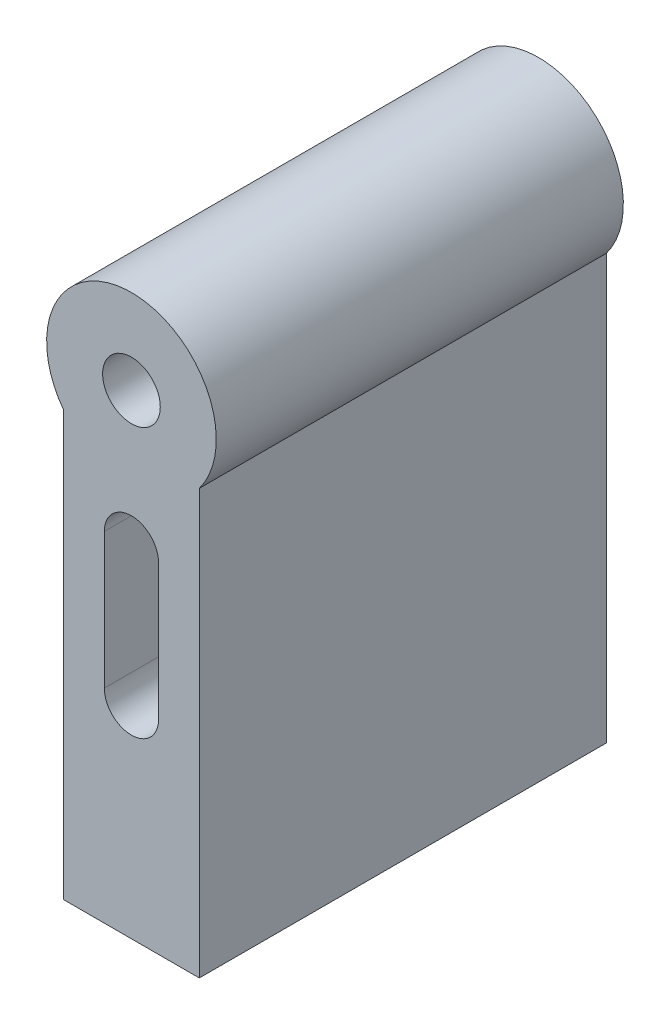
ISO-10303-21;
HEADER;
FILE_DESCRIPTION(('STEP AP214'),'2;1');
FILE_NAME('part.step','',(''),(''),'','','');
FILE_SCHEMA(('AUTOMOTIVE_DESIGN { 1 0 10303 214 1 1 1 1 }'));
ENDSEC;
DATA;
#1=APPLICATION_CONTEXT('core data for automotive mechanical design processes');
#2=APPLICATION_PROTOCOL_DEFINITION('international standard','automotive_design',2000,#1);
#3=PRODUCT_CONTEXT('',#1,'mechanical');
#4=PRODUCT('Part','Part','',(#3));
#5=PRODUCT_RELATED_PRODUCT_CATEGORY('part','',(#4));
#6=PRODUCT_DEFINITION_FORMATION('','',#4);
#7=PRODUCT_DEFINITION_CONTEXT('part definition',#1,'design');
#8=PRODUCT_DEFINITION('design','',#6,#7);
#9=PRODUCT_DEFINITION_SHAPE('','',#8);
#10=(LENGTH_UNIT() NAMED_UNIT(*) SI_UNIT(.MILLI.,.METRE.));
#11=(NAMED_UNIT(*) PLANE_ANGLE_UNIT() SI_UNIT($,.RADIAN.));
#12=(NAMED_UNIT(*) SI_UNIT($,.STERADIAN.) SOLID_ANGLE_UNIT());
#13=UNCERTAINTY_MEASURE_WITH_UNIT(LENGTH_MEASURE(1.E-05),#10,'distance_accuracy_value','');
#14=(GEOMETRIC_REPRESENTATION_CONTEXT(3) GLOBAL_UNCERTAINTY_ASSIGNED_CONTEXT((#13)) GLOBAL_UNIT_ASSIGNED_CONTEXT((#10,
#11,#12)) REPRESENTATION_CONTEXT('',''));
#15=CARTESIAN_POINT('',(0.,0.,0.));
#16=DIRECTION('',(0.,0.,1.));
#17=DIRECTION('',(1.,0.,0.));
#18=AXIS2_PLACEMENT_3D('',#15,#16,#17);
#19=CARTESIAN_POINT('',(-4.,-3.,12.));
#20=DIRECTION('',(1.,0.,0.));
#21=DIRECTION('',(0.,1.,0.));
#22=AXIS2_PLACEMENT_3D('',#19,#20,#21);
#23=PLANE('',#22);
#24=DIRECTION('',(0.,0.,-1.));
#25=VECTOR('',#24,1.);
#26=CARTESIAN_POINT('',(-4.,-20.2,12.));
#27=LINE('',#26,#25);
#28=CARTESIAN_POINT('',(-4.,-20.2,-4.05));
#29=VERTEX_POINT('',#28);
#30=CARTESIAN_POINT('',(-4.,-20.2,-9.95));
#31=VERTEX_POINT('',#30);
#32=EDGE_CURVE('E253',#29,#31,#27,.T.);
#33=ORIENTED_EDGE('',*,*,#32,.F.);
#34=DIRECTION('',(0.,-1.,0.));
#35=VECTOR('',#34,1.);
#36=CARTESIAN_POINT('',(-4.,-3.,-4.05));
#37=LINE('',#36,#35);
#38=CARTESIAN_POINT('',(-4.,-24.2,-4.05));
#39=VERTEX_POINT('',#38);
#40=EDGE_CURVE('E328',#29,#39,#37,.T.);
#41=ORIENTED_EDGE('',*,*,#40,.T.);
#42=DIRECTION('',(0.,0.,-1.));
#43=VECTOR('',#42,1.);
#44=CARTESIAN_POINT('',(-4.,-24.2,12.));
#45=LINE('',#44,#43);
#46=CARTESIAN_POINT('',(-4.,-24.2,-9.95));
#47=VERTEX_POINT('',#46);
#48=EDGE_CURVE('E249',#39,#47,#45,.T.);
#49=ORIENTED_EDGE('',*,*,#48,.T.);
#50=DIRECTION('',(0.,1.,0.));
#51=VECTOR('',#50,1.);
#52=CARTESIAN_POINT('',(-4.,-3.,-9.95));
#53=LINE('',#52,#51);
#54=EDGE_CURVE('E335',#47,#31,#53,.T.);
#55=ORIENTED_EDGE('',*,*,#54,.T.);
#56=EDGE_LOOP('',(#33,#41,#49,#55));
#57=FACE_BOUND('',#56,.T.);
#58=DIRECTION('',(0.,-1.,0.));
#59=VECTOR('',#58,1.);
#60=CARTESIAN_POINT('',(-4.,-3.,-12.));
#61=LINE('',#60,#59);
#62=CARTESIAN_POINT('',(-4.,-3.,-12.));
#63=VERTEX_POINT('',#62);
#64=CARTESIAN_POINT('',(-4.,-28.,-12.));
#65=VERTEX_POINT('',#64);
#66=EDGE_CURVE('E312',#63,#65,#61,.T.);
#67=ORIENTED_EDGE('',*,*,#66,.T.);
#68=DIRECTION('',(0.,0.,-1.));
#69=VECTOR('',#68,1.);
#70=CARTESIAN_POINT('',(-4.,-28.,12.));
#71=LINE('',#70,#69);
#72=CARTESIAN_POINT('',(-4.,-28.,12.));
#73=VERTEX_POINT('',#72);
#74=EDGE_CURVE('E322',#73,#65,#71,.T.);
#75=ORIENTED_EDGE('',*,*,#74,.F.);
#76=DIRECTION('',(0.,-1.,0.));
#77=VECTOR('',#76,1.);
#78=CARTESIAN_POINT('',(-4.,-3.,12.));
#79=LINE('',#78,#77);
#80=CARTESIAN_POINT('',(-4.,-3.,12.));
#81=VERTEX_POINT('',#80);
#82=EDGE_CURVE('E302',#81,#73,#79,.T.);
#83=ORIENTED_EDGE('',*,*,#82,.F.);
#84=DIRECTION('',(0.,0.,-1.));
#85=VECTOR('',#84,1.);
#86=CARTESIAN_POINT('',(-4.,-3.,12.));
#87=LINE('',#86,#85);
#88=EDGE_CURVE('E325',#81,#63,#87,.T.);
#89=ORIENTED_EDGE('',*,*,#88,.T.);
#90=EDGE_LOOP('',(#67,#75,#83,#89));
#91=FACE_BOUND('',#90,.T.);
#92=DIRECTION('',(0.,0.,-1.));
#93=VECTOR('',#92,1.);
#94=CARTESIAN_POINT('',(-4.,-20.2,12.));
#95=LINE('',#94,#93);
#96=CARTESIAN_POINT('',(-4.,-20.2,9.95));
#97=VERTEX_POINT('',#96);
#98=CARTESIAN_POINT('',(-4.,-20.2,4.05));
#99=VERTEX_POINT('',#98);
#100=EDGE_CURVE('E184',#97,#99,#95,.T.);
#101=ORIENTED_EDGE('',*,*,#100,.F.);
#102=DIRECTION('',(0.,1.,0.));
#103=VECTOR('',#102,1.);
#104=CARTESIAN_POINT('',(-4.,-3.,9.95));
#105=LINE('',#104,#103);
#106=CARTESIAN_POINT('',(-4.,-24.2,9.95));
#107=VERTEX_POINT('',#106);
#108=EDGE_CURVE('E61',#107,#97,#105,.T.);
#109=ORIENTED_EDGE('',*,*,#108,.F.);
#110=DIRECTION('',(0.,0.,-1.));
#111=VECTOR('',#110,1.);
#112=CARTESIAN_POINT('',(-4.,-24.2,12.));
#113=LINE('',#112,#111);
#114=CARTESIAN_POINT('',(-4.,-24.2,4.05));
#115=VERTEX_POINT('',#114);
#116=EDGE_CURVE('E207',#107,#115,#113,.T.);
#117=ORIENTED_EDGE('',*,*,#116,.T.);
#118=DIRECTION('',(0.,-1.,0.));
#119=VECTOR('',#118,1.);
#120=CARTESIAN_POINT('',(-4.,-3.,4.05));
#121=LINE('',#120,#119);
#122=EDGE_CURVE('E13',#99,#115,#121,.T.);
#123=ORIENTED_EDGE('',*,*,#122,.F.);
#124=EDGE_LOOP('',(#101,#109,#117,#123));
#125=FACE_BOUND('',#124,.T.);
#126=ADVANCED_FACE('F53',(#57,#91,#125),#23,.F.);
#127=CARTESIAN_POINT('',(0.,0.,12.));
#128=DIRECTION('',(0.,0.,-1.));
#129=DIRECTION('',(-1.,0.,0.));
#130=AXIS2_PLACEMENT_3D('',#127,#128,#129);
#131=PLANE('',#130);
#132=CARTESIAN_POINT('',(0.,0.,12.));
#133=DIRECTION('',(0.,0.,1.));
#134=DIRECTION('',(1.,0.,0.));
#135=AXIS2_PLACEMENT_3D('',#132,#133,#134);
#136=CIRCLE('',#135,1.7);
#137=CARTESIAN_POINT('',(1.7,0.,12.));
#138=VERTEX_POINT('',#137);
#139=EDGE_CURVE('E293',#138,#138,#136,.T.);
#140=ORIENTED_EDGE('',*,*,#139,.F.);
#141=EDGE_LOOP('',(#140));
#142=FACE_BOUND('',#141,.T.);
#143=CARTESIAN_POINT('',(0.,0.,12.));
#144=DIRECTION('',(0.,0.,1.));
#145=DIRECTION('',(-1.,0.,0.));
#146=AXIS2_PLACEMENT_3D('',#143,#144,#145);
#147=CIRCLE('',#146,5.);
#148=CARTESIAN_POINT('',(4.,-3.,12.));
#149=VERTEX_POINT('',#148);
#150=EDGE_CURVE('E299',#149,#81,#147,.T.);
#151=ORIENTED_EDGE('',*,*,#150,.T.);
#152=ORIENTED_EDGE('',*,*,#82,.T.);
#153=DIRECTION('',(1.,0.,0.));
#154=VECTOR('',#153,1.);
#155=CARTESIAN_POINT('',(-4.,-28.,12.));
#156=LINE('',#155,#154);
#157=CARTESIAN_POINT('',(4.,-28.,12.));
#158=VERTEX_POINT('',#157);
#159=EDGE_CURVE('E305',#73,#158,#156,.T.);
#160=ORIENTED_EDGE('',*,*,#159,.T.);
#161=DIRECTION('',(0.,1.,0.));
#162=VECTOR('',#161,1.);
#163=CARTESIAN_POINT('',(4.,-28.,12.));
#164=LINE('',#163,#162);
#165=EDGE_CURVE('E307',#158,#149,#164,.T.);
#166=ORIENTED_EDGE('',*,*,#165,.T.);
#167=EDGE_LOOP('',(#151,#152,#160,#166));
#168=FACE_BOUND('',#167,.T.);
#169=CARTESIAN_POINT('',(0.,-8.,12.));
#170=DIRECTION('',(0.,0.,1.));
#171=DIRECTION('',(1.,0.,0.));
#172=AXIS2_PLACEMENT_3D('',#169,#170,#171);
#173=CIRCLE('',#172,1.6);
#174=CARTESIAN_POINT('',(1.6,-8.,12.));
#175=VERTEX_POINT('',#174);
#176=CARTESIAN_POINT('',(-1.6,-8.,12.));
#177=VERTEX_POINT('',#176);
#178=EDGE_CURVE('E262',#175,#177,#173,.T.);
#179=ORIENTED_EDGE('',*,*,#178,.F.);
#180=DIRECTION('',(0.,1.,0.));
#181=VECTOR('',#180,1.);
#182=CARTESIAN_POINT('',(1.6,-8.,12.));
#183=LINE('',#182,#181);
#184=CARTESIAN_POINT('',(1.6,-16.,12.));
#185=VERTEX_POINT('',#184);
#186=EDGE_CURVE('E270',#185,#175,#183,.T.);
#187=ORIENTED_EDGE('',*,*,#186,.F.);
#188=CARTESIAN_POINT('',(0.,-16.,12.));
#189=DIRECTION('',(0.,0.,1.));
#190=DIRECTION('',(1.,0.,0.));
#191=AXIS2_PLACEMENT_3D('',#188,#189,#190);
#192=CIRCLE('',#191,1.6);
#193=CARTESIAN_POINT('',(-1.6,-16.,12.));
#194=VERTEX_POINT('',#193);
#195=EDGE_CURVE('E267',#194,#185,#192,.T.);
#196=ORIENTED_EDGE('',*,*,#195,.F.);
#197=DIRECTION('',(0.,-1.,0.));
#198=VECTOR('',#197,1.);
#199=CARTESIAN_POINT('',(-1.6,-8.,12.));
#200=LINE('',#199,#198);
#201=EDGE_CURVE('E264',#177,#194,#200,.T.);
#202=ORIENTED_EDGE('',*,*,#201,.F.);
#203=EDGE_LOOP('',(#179,#187,#196,#202));
#204=FACE_BOUND('',#203,.T.);
#205=ADVANCED_FACE('F371',(#142,#168,#204),#131,.F.);
#206=CARTESIAN_POINT('',(0.,0.,-12.));
#207=DIRECTION('',(0.,0.,-1.));
#208=DIRECTION('',(-1.,0.,0.));
#209=AXIS2_PLACEMENT_3D('',#206,#207,#208);
#210=PLANE('',#209);
#211=CARTESIAN_POINT('',(0.,0.,-12.));
#212=DIRECTION('',(0.,0.,1.));
#213=DIRECTION('',(-1.,0.,0.));
#214=AXIS2_PLACEMENT_3D('',#211,#212,#213);
#215=CIRCLE('',#214,5.);
#216=CARTESIAN_POINT('',(4.,-3.,-12.));
#217=VERTEX_POINT('',#216);
#218=EDGE_CURVE('E296',#217,#63,#215,.T.);
#219=ORIENTED_EDGE('',*,*,#218,.F.);
#220=DIRECTION('',(0.,1.,0.));
#221=VECTOR('',#220,1.);
#222=CARTESIAN_POINT('',(4.,-28.,-12.));
#223=LINE('',#222,#221);
#224=CARTESIAN_POINT('',(4.,-28.,-12.));
#225=VERTEX_POINT('',#224);
#226=EDGE_CURVE('E303',#225,#217,#223,.T.);
#227=ORIENTED_EDGE('',*,*,#226,.F.);
#228=DIRECTION('',(1.,0.,0.));
#229=VECTOR('',#228,1.);
#230=CARTESIAN_POINT('',(-4.,-28.,-12.));
#231=LINE('',#230,#229);
#232=EDGE_CURVE('E314',#65,#225,#231,.T.);
#233=ORIENTED_EDGE('',*,*,#232,.F.);
#234=ORIENTED_EDGE('',*,*,#66,.F.);
#235=EDGE_LOOP('',(#219,#227,#233,#234));
#236=FACE_BOUND('',#235,.T.);
#237=CARTESIAN_POINT('',(0.,0.,-12.));
#238=DIRECTION('',(0.,0.,1.));
#239=DIRECTION('',(1.,0.,0.));
#240=AXIS2_PLACEMENT_3D('',#237,#238,#239);
#241=CIRCLE('',#240,1.7);
#242=CARTESIAN_POINT('',(1.7,0.,-12.));
#243=VERTEX_POINT('',#242);
#244=EDGE_CURVE('E292',#243,#243,#241,.T.);
#245=ORIENTED_EDGE('',*,*,#244,.T.);
#246=EDGE_LOOP('',(#245));
#247=FACE_BOUND('',#246,.T.);
#248=DIRECTION('',(0.,1.,0.));
#249=VECTOR('',#248,1.);
#250=CARTESIAN_POINT('',(1.6,-8.,-12.));
#251=LINE('',#250,#249);
#252=CARTESIAN_POINT('',(1.6,-16.,-12.));
#253=VERTEX_POINT('',#252);
#254=CARTESIAN_POINT('',(1.6,-8.,-12.));
#255=VERTEX_POINT('',#254);
#256=EDGE_CURVE('E265',#253,#255,#251,.T.);
#257=ORIENTED_EDGE('',*,*,#256,.T.);
#258=CARTESIAN_POINT('',(0.,-8.,-12.));
#259=DIRECTION('',(0.,0.,1.));
#260=DIRECTION('',(1.,0.,0.));
#261=AXIS2_PLACEMENT_3D('',#258,#259,#260);
#262=CIRCLE('',#261,1.6);
#263=CARTESIAN_POINT('',(-1.6,-8.,-12.));
#264=VERTEX_POINT('',#263);
#265=EDGE_CURVE('E259',#255,#264,#262,.T.);
#266=ORIENTED_EDGE('',*,*,#265,.T.);
#267=DIRECTION('',(0.,-1.,0.));
#268=VECTOR('',#267,1.);
#269=CARTESIAN_POINT('',(-1.6,-8.,-12.));
#270=LINE('',#269,#268);
#271=CARTESIAN_POINT('',(-1.6,-16.,-12.));
#272=VERTEX_POINT('',#271);
#273=EDGE_CURVE('E275',#264,#272,#270,.T.);
#274=ORIENTED_EDGE('',*,*,#273,.T.);
#275=CARTESIAN_POINT('',(0.,-16.,-12.));
#276=DIRECTION('',(0.,0.,1.));
#277=DIRECTION('',(1.,0.,0.));
#278=AXIS2_PLACEMENT_3D('',#275,#276,#277);
#279=CIRCLE('',#278,1.6);
#280=EDGE_CURVE('E278',#272,#253,#279,.T.);
#281=ORIENTED_EDGE('',*,*,#280,.T.);
#282=EDGE_LOOP('',(#257,#266,#274,#281));
#283=FACE_BOUND('',#282,.T.);
#284=ADVANCED_FACE('F376',(#236,#247,#283),#210,.T.);
#285=CARTESIAN_POINT('',(0.,0.,12.));
#286=DIRECTION('',(0.,0.,-1.));
#287=DIRECTION('',(-1.,0.,0.));
#288=AXIS2_PLACEMENT_3D('',#285,#286,#287);
#289=CYLINDRICAL_SURFACE('',#288,5.);
#290=ORIENTED_EDGE('',*,*,#218,.T.);
#291=ORIENTED_EDGE('',*,*,#88,.F.);
#292=ORIENTED_EDGE('',*,*,#150,.F.);
#293=DIRECTION('',(0.,0.,-1.));
#294=VECTOR('',#293,1.);
#295=CARTESIAN_POINT('',(4.,-3.,12.));
#296=LINE('',#295,#294);
#297=EDGE_CURVE('E309',#149,#217,#296,.T.);
#298=ORIENTED_EDGE('',*,*,#297,.T.);
#299=EDGE_LOOP('',(#290,#291,#292,#298));
#300=FACE_BOUND('',#299,.T.);
#301=ADVANCED_FACE('F55',(#300),#289,.T.);
#302=CARTESIAN_POINT('',(-4.,-28.,12.));
#303=DIRECTION('',(0.,1.,0.));
#304=DIRECTION('',(0.,0.,1.));
#305=AXIS2_PLACEMENT_3D('',#302,#303,#304);
#306=PLANE('',#305);
#307=CARTESIAN_POINT('',(0.,-28.,7.));
#308=DIRECTION('',(0.,1.,0.));
#309=DIRECTION('',(0.,0.,1.));
#310=AXIS2_PLACEMENT_3D('',#307,#308,#309);
#311=CIRCLE('',#310,1.7);
#312=CARTESIAN_POINT('',(0.,-28.,8.7));
#313=VERTEX_POINT('',#312);
#314=EDGE_CURVE('E213',#313,#313,#311,.T.);
#315=ORIENTED_EDGE('',*,*,#314,.T.);
#316=EDGE_LOOP('',(#315));
#317=FACE_BOUND('',#316,.T.);
#318=CARTESIAN_POINT('',(0.,-28.,-7.));
#319=DIRECTION('',(0.,-1.,0.));
#320=DIRECTION('',(0.,0.,-1.));
#321=AXIS2_PLACEMENT_3D('',#318,#319,#320);
#322=CIRCLE('',#321,1.7);
#323=CARTESIAN_POINT('',(0.,-28.,-8.7));
#324=VERTEX_POINT('',#323);
#325=EDGE_CURVE('E255',#324,#324,#322,.T.);
#326=ORIENTED_EDGE('',*,*,#325,.F.);
#327=EDGE_LOOP('',(#326));
#328=FACE_BOUND('',#327,.T.);
#329=ORIENTED_EDGE('',*,*,#232,.T.);
#330=DIRECTION('',(0.,0.,-1.));
#331=VECTOR('',#330,1.);
#332=CARTESIAN_POINT('',(4.,-28.,12.));
#333=LINE('',#332,#331);
#334=EDGE_CURVE('E319',#158,#225,#333,.T.);
#335=ORIENTED_EDGE('',*,*,#334,.F.);
#336=ORIENTED_EDGE('',*,*,#159,.F.);
#337=ORIENTED_EDGE('',*,*,#74,.T.);
#338=EDGE_LOOP('',(#329,#335,#336,#337));
#339=FACE_BOUND('',#338,.T.);
#340=ADVANCED_FACE('F382',(#317,#328,#339),#306,.F.);
#341=CARTESIAN_POINT('',(4.,-28.,12.));
#342=DIRECTION('',(-1.,0.,0.));
#343=DIRECTION('',(0.,-1.,0.));
#344=AXIS2_PLACEMENT_3D('',#341,#342,#343);
#345=PLANE('',#344);
#346=ORIENTED_EDGE('',*,*,#226,.T.);
#347=ORIENTED_EDGE('',*,*,#297,.F.);
#348=ORIENTED_EDGE('',*,*,#165,.F.);
#349=ORIENTED_EDGE('',*,*,#334,.T.);
#350=EDGE_LOOP('',(#346,#347,#348,#349));
#351=FACE_BOUND('',#350,.T.);
#352=ADVANCED_FACE('F385',(#351),#345,.F.);
#353=CARTESIAN_POINT('',(0.,0.,12.));
#354=DIRECTION('',(0.,0.,-1.));
#355=DIRECTION('',(-1.,0.,0.));
#356=AXIS2_PLACEMENT_3D('',#353,#354,#355);
#357=CYLINDRICAL_SURFACE('',#356,1.7);
#358=ORIENTED_EDGE('',*,*,#139,.T.);
#359=EDGE_LOOP('',(#358));
#360=FACE_BOUND('',#359,.T.);
#361=ORIENTED_EDGE('',*,*,#244,.F.);
#362=EDGE_LOOP('',(#361));
#363=FACE_BOUND('',#362,.T.);
#364=ADVANCED_FACE('F389',(#360,#363),#357,.F.);
#365=CARTESIAN_POINT('',(0.,-8.,12.));
#366=DIRECTION('',(0.,0.,-1.));
#367=DIRECTION('',(-1.,0.,0.));
#368=AXIS2_PLACEMENT_3D('',#365,#366,#367);
#369=CYLINDRICAL_SURFACE('',#368,1.6);
#370=ORIENTED_EDGE('',*,*,#265,.F.);
#371=DIRECTION('',(0.,0.,-1.));
#372=VECTOR('',#371,1.);
#373=CARTESIAN_POINT('',(1.6,-8.,12.));
#374=LINE('',#373,#372);
#375=EDGE_CURVE('E272',#175,#255,#374,.T.);
#376=ORIENTED_EDGE('',*,*,#375,.F.);
#377=ORIENTED_EDGE('',*,*,#178,.T.);
#378=DIRECTION('',(0.,0.,-1.));
#379=VECTOR('',#378,1.);
#380=CARTESIAN_POINT('',(-1.6,-8.,12.));
#381=LINE('',#380,#379);
#382=EDGE_CURVE('E289',#177,#264,#381,.T.);
#383=ORIENTED_EDGE('',*,*,#382,.T.);
#384=EDGE_LOOP('',(#370,#376,#377,#383));
#385=FACE_BOUND('',#384,.T.);
#386=ADVANCED_FACE('F396',(#385),#369,.F.);
#387=CARTESIAN_POINT('',(-1.6,-8.,12.));
#388=DIRECTION('',(1.,0.,0.));
#389=DIRECTION('',(0.,1.,0.));
#390=AXIS2_PLACEMENT_3D('',#387,#388,#389);
#391=PLANE('',#390);
#392=ORIENTED_EDGE('',*,*,#273,.F.);
#393=ORIENTED_EDGE('',*,*,#382,.F.);
#394=ORIENTED_EDGE('',*,*,#201,.T.);
#395=DIRECTION('',(0.,0.,-1.));
#396=VECTOR('',#395,1.);
#397=CARTESIAN_POINT('',(-1.6,-16.,12.));
#398=LINE('',#397,#396);
#399=EDGE_CURVE('E287',#194,#272,#398,.T.);
#400=ORIENTED_EDGE('',*,*,#399,.T.);
#401=EDGE_LOOP('',(#392,#393,#394,#400));
#402=FACE_BOUND('',#401,.T.);
#403=ADVANCED_FACE('F400',(#402),#391,.T.);
#404=CARTESIAN_POINT('',(0.,-16.,12.));
#405=DIRECTION('',(0.,0.,-1.));
#406=DIRECTION('',(-1.,0.,0.));
#407=AXIS2_PLACEMENT_3D('',#404,#405,#406);
#408=CYLINDRICAL_SURFACE('',#407,1.6);
#409=ORIENTED_EDGE('',*,*,#280,.F.);
#410=ORIENTED_EDGE('',*,*,#399,.F.);
#411=ORIENTED_EDGE('',*,*,#195,.T.);
#412=DIRECTION('',(0.,0.,-1.));
#413=VECTOR('',#412,1.);
#414=CARTESIAN_POINT('',(1.6,-16.,12.));
#415=LINE('',#414,#413);
#416=EDGE_CURVE('E285',#185,#253,#415,.T.);
#417=ORIENTED_EDGE('',*,*,#416,.T.);
#418=EDGE_LOOP('',(#409,#410,#411,#417));
#419=FACE_BOUND('',#418,.T.);
#420=ADVANCED_FACE('F404',(#419),#408,.F.);
#421=CARTESIAN_POINT('',(1.6,-8.,12.));
#422=DIRECTION('',(-1.,0.,0.));
#423=DIRECTION('',(0.,-1.,0.));
#424=AXIS2_PLACEMENT_3D('',#421,#422,#423);
#425=PLANE('',#424);
#426=ORIENTED_EDGE('',*,*,#256,.F.);
#427=ORIENTED_EDGE('',*,*,#416,.F.);
#428=ORIENTED_EDGE('',*,*,#186,.T.);
#429=ORIENTED_EDGE('',*,*,#375,.T.);
#430=EDGE_LOOP('',(#426,#427,#428,#429));
#431=FACE_BOUND('',#430,.T.);
#432=ADVANCED_FACE('F408',(#431),#425,.T.);
#433=CARTESIAN_POINT('',(0.,-18.,-7.));
#434=DIRECTION('',(0.,-1.,0.));
#435=DIRECTION('',(0.,0.,-1.));
#436=AXIS2_PLACEMENT_3D('',#433,#434,#435);
#437=CYLINDRICAL_SURFACE('',#436,1.7);
#438=CARTESIAN_POINT('',(0.,-24.2,-7.));
#439=DIRECTION('',(0.,-1.,0.));
#440=DIRECTION('',(0.,0.,-1.));
#441=AXIS2_PLACEMENT_3D('',#438,#439,#440);
#442=CIRCLE('',#441,1.7);
#443=CARTESIAN_POINT('',(0.,-24.2,-8.7));
#444=VERTEX_POINT('',#443);
#445=EDGE_CURVE('E244',#444,#444,#442,.F.);
#446=ORIENTED_EDGE('',*,*,#445,.T.);
#447=EDGE_LOOP('',(#446));
#448=FACE_BOUND('',#447,.T.);
#449=ORIENTED_EDGE('',*,*,#325,.T.);
#450=EDGE_LOOP('',(#449));
#451=FACE_BOUND('',#450,.T.);
#452=ADVANCED_FACE('F412',(#448,#451),#437,.F.);
#453=CARTESIAN_POINT('',(-1.70318329410939,-20.2,-9.95));
#454=DIRECTION('',(0.,0.,-1.));
#455=DIRECTION('',(-1.,0.,0.));
#456=AXIS2_PLACEMENT_3D('',#453,#454,#455);
#457=PLANE('',#456);
#458=DIRECTION('',(1.,0.,0.));
#459=VECTOR('',#458,1.);
#460=CARTESIAN_POINT('',(-1.70318329410939,-24.2,-9.95));
#461=LINE('',#460,#459);
#462=CARTESIAN_POINT('',(1.7031832941094,-24.2,-9.95));
#463=VERTEX_POINT('',#462);
#464=EDGE_CURVE('E75',#47,#463,#461,.T.);
#465=ORIENTED_EDGE('',*,*,#464,.T.);
#466=DIRECTION('',(0.,-1.,0.));
#467=VECTOR('',#466,1.);
#468=CARTESIAN_POINT('',(1.7031832941094,-20.2,-9.95));
#469=LINE('',#468,#467);
#470=CARTESIAN_POINT('',(1.7031832941094,-20.2,-9.95));
#471=VERTEX_POINT('',#470);
#472=EDGE_CURVE('E231',#471,#463,#469,.T.);
#473=ORIENTED_EDGE('',*,*,#472,.F.);
#474=DIRECTION('',(1.,0.,0.));
#475=VECTOR('',#474,1.);
#476=CARTESIAN_POINT('',(-1.70318329410939,-20.2,-9.95));
#477=LINE('',#476,#475);
#478=EDGE_CURVE('E220',#31,#471,#477,.T.);
#479=ORIENTED_EDGE('',*,*,#478,.F.);
#480=ORIENTED_EDGE('',*,*,#54,.F.);
#481=EDGE_LOOP('',(#465,#473,#479,#480));
#482=FACE_BOUND('',#481,.T.);
#483=ADVANCED_FACE('F416',(#482),#457,.F.);
#484=CARTESIAN_POINT('',(-5.,-20.2,-4.05));
#485=DIRECTION('',(0.,0.,1.));
#486=DIRECTION('',(1.,0.,0.));
#487=AXIS2_PLACEMENT_3D('',#484,#485,#486);
#488=PLANE('',#487);
#489=DIRECTION('',(-1.,0.,0.));
#490=VECTOR('',#489,1.);
#491=CARTESIAN_POINT('',(1.7031832941094,-20.2,-4.05));
#492=LINE('',#491,#490);
#493=CARTESIAN_POINT('',(1.7031832941094,-20.2,-4.05));
#494=VERTEX_POINT('',#493);
#495=EDGE_CURVE('E228',#494,#29,#492,.T.);
#496=ORIENTED_EDGE('',*,*,#495,.F.);
#497=DIRECTION('',(0.,-1.,0.));
#498=VECTOR('',#497,1.);
#499=CARTESIAN_POINT('',(1.7031832941094,-20.2,-4.05));
#500=LINE('',#499,#498);
#501=CARTESIAN_POINT('',(1.7031832941094,-24.2,-4.05));
#502=VERTEX_POINT('',#501);
#503=EDGE_CURVE('E241',#494,#502,#500,.T.);
#504=ORIENTED_EDGE('',*,*,#503,.T.);
#505=DIRECTION('',(-1.,0.,0.));
#506=VECTOR('',#505,1.);
#507=CARTESIAN_POINT('',(-5.,-24.2,-4.05));
#508=LINE('',#507,#506);
#509=EDGE_CURVE('E237',#502,#39,#508,.T.);
#510=ORIENTED_EDGE('',*,*,#509,.T.);
#511=ORIENTED_EDGE('',*,*,#40,.F.);
#512=EDGE_LOOP('',(#496,#504,#510,#511));
#513=FACE_BOUND('',#512,.T.);
#514=ADVANCED_FACE('F432',(#513),#488,.F.);
#515=CARTESIAN_POINT('',(0.,-20.2,0.));
#516=DIRECTION('',(0.,-1.,0.));
#517=DIRECTION('',(0.,0.,-1.));
#518=AXIS2_PLACEMENT_3D('',#515,#516,#517);
#519=PLANE('',#518);
#520=CARTESIAN_POINT('',(0.,-20.2,-7.));
#521=DIRECTION('',(0.,-1.,0.));
#522=DIRECTION('',(0.,0.,-1.));
#523=AXIS2_PLACEMENT_3D('',#520,#521,#522);
#524=CIRCLE('',#523,1.7);
#525=CARTESIAN_POINT('',(0.,-20.2,-8.7));
#526=VERTEX_POINT('',#525);
#527=EDGE_CURVE('E252',#526,#526,#524,.F.);
#528=ORIENTED_EDGE('',*,*,#527,.T.);
#529=EDGE_LOOP('',(#528));
#530=FACE_BOUND('',#529,.T.);
#531=ORIENTED_EDGE('',*,*,#32,.T.);
#532=ORIENTED_EDGE('',*,*,#478,.T.);
#533=DIRECTION('',(0.5,0.,0.866025403784439));
#534=VECTOR('',#533,1.);
#535=CARTESIAN_POINT('',(1.7031832941094,-20.2,-9.95));
#536=LINE('',#535,#534);
#537=CARTESIAN_POINT('',(3.40636658821879,-20.2,-7.));
#538=VERTEX_POINT('',#537);
#539=EDGE_CURVE('E222',#471,#538,#536,.T.);
#540=ORIENTED_EDGE('',*,*,#539,.T.);
#541=DIRECTION('',(-0.5,0.,0.866025403784438));
#542=VECTOR('',#541,1.);
#543=CARTESIAN_POINT('',(3.40636658821879,-20.2,-7.));
#544=LINE('',#543,#542);
#545=EDGE_CURVE('E225',#538,#494,#544,.T.);
#546=ORIENTED_EDGE('',*,*,#545,.T.);
#547=ORIENTED_EDGE('',*,*,#495,.T.);
#548=EDGE_LOOP('',(#531,#532,#540,#546,#547));
#549=FACE_BOUND('',#548,.T.);
#550=ADVANCED_FACE('F435',(#530,#549),#519,.T.);
#551=CARTESIAN_POINT('',(0.,-24.2,0.));
#552=DIRECTION('',(0.,-1.,0.));
#553=DIRECTION('',(0.,0.,-1.));
#554=AXIS2_PLACEMENT_3D('',#551,#552,#553);
#555=PLANE('',#554);
#556=ORIENTED_EDGE('',*,*,#445,.F.);
#557=EDGE_LOOP('',(#556));
#558=FACE_BOUND('',#557,.T.);
#559=ORIENTED_EDGE('',*,*,#509,.F.);
#560=DIRECTION('',(-0.5,0.,0.866025403784438));
#561=VECTOR('',#560,1.);
#562=CARTESIAN_POINT('',(3.40636658821879,-24.2,-7.));
#563=LINE('',#562,#561);
#564=CARTESIAN_POINT('',(3.40636658821879,-24.2,-7.));
#565=VERTEX_POINT('',#564);
#566=EDGE_CURVE('E234',#565,#502,#563,.T.);
#567=ORIENTED_EDGE('',*,*,#566,.F.);
#568=DIRECTION('',(0.5,0.,0.866025403784439));
#569=VECTOR('',#568,1.);
#570=CARTESIAN_POINT('',(1.7031832941094,-24.2,-9.95));
#571=LINE('',#570,#569);
#572=EDGE_CURVE('E217',#463,#565,#571,.T.);
#573=ORIENTED_EDGE('',*,*,#572,.F.);
#574=ORIENTED_EDGE('',*,*,#464,.F.);
#575=ORIENTED_EDGE('',*,*,#48,.F.);
#576=EDGE_LOOP('',(#559,#567,#573,#574,#575));
#577=FACE_BOUND('',#576,.T.);
#578=ADVANCED_FACE('F430',(#558,#577),#555,.F.);
#579=CARTESIAN_POINT('',(3.40636658821879,-20.2,-7.));
#580=DIRECTION('',(0.866025403784438,0.,0.5));
#581=DIRECTION('',(0.5,0.,-0.866025403784439));
#582=AXIS2_PLACEMENT_3D('',#579,#580,#581);
#583=PLANE('',#582);
#584=ORIENTED_EDGE('',*,*,#566,.T.);
#585=ORIENTED_EDGE('',*,*,#503,.F.);
#586=ORIENTED_EDGE('',*,*,#545,.F.);
#587=DIRECTION('',(0.,-1.,0.));
#588=VECTOR('',#587,1.);
#589=CARTESIAN_POINT('',(3.40636658821879,-20.2,-7.));
#590=LINE('',#589,#588);
#591=EDGE_CURVE('E245',#538,#565,#590,.T.);
#592=ORIENTED_EDGE('',*,*,#591,.T.);
#593=EDGE_LOOP('',(#584,#585,#586,#592));
#594=FACE_BOUND('',#593,.T.);
#595=ADVANCED_FACE('F426',(#594),#583,.F.);
#596=CARTESIAN_POINT('',(1.7031832941094,-20.2,-9.95));
#597=DIRECTION('',(0.866025403784439,0.,-0.5));
#598=DIRECTION('',(-0.5,0.,-0.866025403784439));
#599=AXIS2_PLACEMENT_3D('',#596,#597,#598);
#600=PLANE('',#599);
#601=ORIENTED_EDGE('',*,*,#572,.T.);
#602=ORIENTED_EDGE('',*,*,#591,.F.);
#603=ORIENTED_EDGE('',*,*,#539,.F.);
#604=ORIENTED_EDGE('',*,*,#472,.T.);
#605=EDGE_LOOP('',(#601,#602,#603,#604));
#606=FACE_BOUND('',#605,.T.);
#607=ADVANCED_FACE('F422',(#606),#600,.F.);
#608=CARTESIAN_POINT('',(0.,-18.,-7.));
#609=DIRECTION('',(0.,-1.,0.));
#610=DIRECTION('',(0.,0.,-1.));
#611=AXIS2_PLACEMENT_3D('',#608,#609,#610);
#612=PLANE('',#611);
#613=CARTESIAN_POINT('',(0.,-18.,-7.));
#614=DIRECTION('',(0.,-1.,0.));
#615=DIRECTION('',(0.,0.,-1.));
#616=AXIS2_PLACEMENT_3D('',#613,#614,#615);
#617=CIRCLE('',#616,1.7);
#618=CARTESIAN_POINT('',(0.,-18.,-8.7));
#619=VERTEX_POINT('',#618);
#620=EDGE_CURVE('E256',#619,#619,#617,.T.);
#621=ORIENTED_EDGE('',*,*,#620,.T.);
#622=EDGE_LOOP('',(#621));
#623=FACE_BOUND('',#622,.T.);
#624=ADVANCED_FACE('F419',(#623),#612,.T.);
#625=ORIENTED_EDGE('',*,*,#620,.F.);
#626=EDGE_LOOP('',(#625));
#627=FACE_BOUND('',#626,.T.);
#628=ORIENTED_EDGE('',*,*,#527,.F.);
#629=EDGE_LOOP('',(#628));
#630=FACE_BOUND('',#629,.T.);
#631=ADVANCED_FACE('F418',(#627,#630),#437,.F.);
#632=CARTESIAN_POINT('',(0.,-18.,7.));
#633=DIRECTION('',(0.,-1.,0.));
#634=DIRECTION('',(0.,0.,-1.));
#635=AXIS2_PLACEMENT_3D('',#632,#633,#634);
#636=CYLINDRICAL_SURFACE('',#635,1.7);
#637=CARTESIAN_POINT('',(0.,-24.2,7.));
#638=DIRECTION('',(0.,-1.,0.));
#639=DIRECTION('',(0.,0.,-1.));
#640=AXIS2_PLACEMENT_3D('',#637,#638,#639);
#641=CIRCLE('',#640,1.7);
#642=CARTESIAN_POINT('',(0.,-24.2,5.3));
#643=VERTEX_POINT('',#642);
#644=EDGE_CURVE('E211',#643,#643,#641,.T.);
#645=ORIENTED_EDGE('',*,*,#644,.F.);
#646=EDGE_LOOP('',(#645));
#647=FACE_BOUND('',#646,.T.);
#648=ORIENTED_EDGE('',*,*,#314,.F.);
#649=EDGE_LOOP('',(#648));
#650=FACE_BOUND('',#649,.T.);
#651=ADVANCED_FACE('F446',(#647,#650),#636,.F.);
#652=CARTESIAN_POINT('',(1.7031832941094,-20.2,4.05));
#653=DIRECTION('',(0.,0.,1.));
#654=DIRECTION('',(1.,0.,0.));
#655=AXIS2_PLACEMENT_3D('',#652,#653,#654);
#656=PLANE('',#655);
#657=ORIENTED_EDGE('',*,*,#122,.T.);
#658=DIRECTION('',(-1.,0.,0.));
#659=VECTOR('',#658,1.);
#660=CARTESIAN_POINT('',(1.7031832941094,-24.2,4.05));
#661=LINE('',#660,#659);
#662=CARTESIAN_POINT('',(1.7031832941094,-24.2,4.05));
#663=VERTEX_POINT('',#662);
#664=EDGE_CURVE('E68',#663,#115,#661,.T.);
#665=ORIENTED_EDGE('',*,*,#664,.F.);
#666=DIRECTION('',(0.,-1.,0.));
#667=VECTOR('',#666,1.);
#668=CARTESIAN_POINT('',(1.7031832941094,-20.2,4.05));
#669=LINE('',#668,#667);
#670=CARTESIAN_POINT('',(1.7031832941094,-20.2,4.05));
#671=VERTEX_POINT('',#670);
#672=EDGE_CURVE('E195',#671,#663,#669,.T.);
#673=ORIENTED_EDGE('',*,*,#672,.F.);
#674=DIRECTION('',(-1.,0.,0.));
#675=VECTOR('',#674,1.);
#676=CARTESIAN_POINT('',(-5.,-20.2,4.05));
#677=LINE('',#676,#675);
#678=EDGE_CURVE('E177',#671,#99,#677,.T.);
#679=ORIENTED_EDGE('',*,*,#678,.T.);
#680=EDGE_LOOP('',(#657,#665,#673,#679));
#681=FACE_BOUND('',#680,.T.);
#682=ADVANCED_FACE('F200',(#681),#656,.T.);
#683=CARTESIAN_POINT('',(-1.70318329410939,-20.2,9.95));
#684=DIRECTION('',(0.,0.,-1.));
#685=DIRECTION('',(-1.,0.,0.));
#686=AXIS2_PLACEMENT_3D('',#683,#684,#685);
#687=PLANE('',#686);
#688=ORIENTED_EDGE('',*,*,#108,.T.);
#689=DIRECTION('',(1.,0.,0.));
#690=VECTOR('',#689,1.);
#691=CARTESIAN_POINT('',(-1.70318329410939,-20.2,9.95));
#692=LINE('',#691,#690);
#693=CARTESIAN_POINT('',(1.7031832941094,-20.2,9.95));
#694=VERTEX_POINT('',#693);
#695=EDGE_CURVE('E188',#97,#694,#692,.T.);
#696=ORIENTED_EDGE('',*,*,#695,.T.);
#697=DIRECTION('',(0.,-1.,0.));
#698=VECTOR('',#697,1.);
#699=CARTESIAN_POINT('',(1.7031832941094,-20.2,9.95));
#700=LINE('',#699,#698);
#701=CARTESIAN_POINT('',(1.7031832941094,-24.2,9.95));
#702=VERTEX_POINT('',#701);
#703=EDGE_CURVE('E202',#694,#702,#700,.T.);
#704=ORIENTED_EDGE('',*,*,#703,.T.);
#705=DIRECTION('',(1.,0.,0.));
#706=VECTOR('',#705,1.);
#707=CARTESIAN_POINT('',(-1.70318329410939,-24.2,9.95));
#708=LINE('',#707,#706);
#709=EDGE_CURVE('E346',#107,#702,#708,.T.);
#710=ORIENTED_EDGE('',*,*,#709,.F.);
#711=EDGE_LOOP('',(#688,#696,#704,#710));
#712=FACE_BOUND('',#711,.T.);
#713=ADVANCED_FACE('F344',(#712),#687,.T.);
#714=CARTESIAN_POINT('',(0.,-20.2,0.));
#715=DIRECTION('',(0.,-1.,0.));
#716=DIRECTION('',(0.,0.,1.));
#717=AXIS2_PLACEMENT_3D('',#714,#715,#716);
#718=PLANE('',#717);
#719=CARTESIAN_POINT('',(0.,-20.2,7.));
#720=DIRECTION('',(0.,-1.,0.));
#721=DIRECTION('',(0.,0.,-1.));
#722=AXIS2_PLACEMENT_3D('',#719,#720,#721);
#723=CIRCLE('',#722,1.7);
#724=CARTESIAN_POINT('',(0.,-20.2,5.3));
#725=VERTEX_POINT('',#724);
#726=EDGE_CURVE('E210',#725,#725,#723,.T.);
#727=ORIENTED_EDGE('',*,*,#726,.F.);
#728=EDGE_LOOP('',(#727));
#729=FACE_BOUND('',#728,.T.);
#730=ORIENTED_EDGE('',*,*,#100,.T.);
#731=ORIENTED_EDGE('',*,*,#678,.F.);
#732=DIRECTION('',(-0.5,0.,-0.866025403784438));
#733=VECTOR('',#732,1.);
#734=CARTESIAN_POINT('',(3.40636658821879,-20.2,7.));
#735=LINE('',#734,#733);
#736=CARTESIAN_POINT('',(3.40636658821879,-20.2,7.));
#737=VERTEX_POINT('',#736);
#738=EDGE_CURVE('E181',#737,#671,#735,.T.);
#739=ORIENTED_EDGE('',*,*,#738,.F.);
#740=DIRECTION('',(0.5,0.,-0.866025403784439));
#741=VECTOR('',#740,1.);
#742=CARTESIAN_POINT('',(1.7031832941094,-20.2,9.95));
#743=LINE('',#742,#741);
#744=EDGE_CURVE('E198',#694,#737,#743,.T.);
#745=ORIENTED_EDGE('',*,*,#744,.F.);
#746=ORIENTED_EDGE('',*,*,#695,.F.);
#747=EDGE_LOOP('',(#730,#731,#739,#745,#746));
#748=FACE_BOUND('',#747,.T.);
#749=ADVANCED_FACE('F179',(#729,#748),#718,.T.);
#750=CARTESIAN_POINT('',(0.,-24.2,0.));
#751=DIRECTION('',(0.,-1.,0.));
#752=DIRECTION('',(0.,0.,1.));
#753=AXIS2_PLACEMENT_3D('',#750,#751,#752);
#754=PLANE('',#753);
#755=ORIENTED_EDGE('',*,*,#644,.T.);
#756=EDGE_LOOP('',(#755));
#757=FACE_BOUND('',#756,.T.);
#758=ORIENTED_EDGE('',*,*,#709,.T.);
#759=DIRECTION('',(0.5,0.,-0.866025403784439));
#760=VECTOR('',#759,1.);
#761=CARTESIAN_POINT('',(1.7031832941094,-24.2,9.95));
#762=LINE('',#761,#760);
#763=CARTESIAN_POINT('',(3.40636658821879,-24.2,7.));
#764=VERTEX_POINT('',#763);
#765=EDGE_CURVE('E349',#702,#764,#762,.T.);
#766=ORIENTED_EDGE('',*,*,#765,.T.);
#767=DIRECTION('',(-0.5,0.,-0.866025403784438));
#768=VECTOR('',#767,1.);
#769=CARTESIAN_POINT('',(3.40636658821879,-24.2,7.));
#770=LINE('',#769,#768);
#771=EDGE_CURVE('E356',#764,#663,#770,.T.);
#772=ORIENTED_EDGE('',*,*,#771,.T.);
#773=ORIENTED_EDGE('',*,*,#664,.T.);
#774=ORIENTED_EDGE('',*,*,#116,.F.);
#775=EDGE_LOOP('',(#758,#766,#772,#773,#774));
#776=FACE_BOUND('',#775,.T.);
#777=ADVANCED_FACE('F351',(#757,#776),#754,.F.);
#778=CARTESIAN_POINT('',(1.7031832941094,-20.2,9.95));
#779=DIRECTION('',(-0.866025403784439,0.,-0.5));
#780=DIRECTION('',(-0.5,0.,0.866025403784439));
#781=AXIS2_PLACEMENT_3D('',#778,#779,#780);
#782=PLANE('',#781);
#783=ORIENTED_EDGE('',*,*,#765,.F.);
#784=ORIENTED_EDGE('',*,*,#703,.F.);
#785=ORIENTED_EDGE('',*,*,#744,.T.);
#786=DIRECTION('',(0.,-1.,0.));
#787=VECTOR('',#786,1.);
#788=CARTESIAN_POINT('',(3.40636658821879,-20.2,7.));
#789=LINE('',#788,#787);
#790=EDGE_CURVE('E197',#737,#764,#789,.T.);
#791=ORIENTED_EDGE('',*,*,#790,.T.);
#792=EDGE_LOOP('',(#783,#784,#785,#791));
#793=FACE_BOUND('',#792,.T.);
#794=ADVANCED_FACE('F355',(#793),#782,.T.);
#795=CARTESIAN_POINT('',(3.40636658821879,-20.2,7.));
#796=DIRECTION('',(-0.866025403784438,0.,0.5));
#797=DIRECTION('',(0.5,0.,0.866025403784439));
#798=AXIS2_PLACEMENT_3D('',#795,#796,#797);
#799=PLANE('',#798);
#800=ORIENTED_EDGE('',*,*,#771,.F.);
#801=ORIENTED_EDGE('',*,*,#790,.F.);
#802=ORIENTED_EDGE('',*,*,#738,.T.);
#803=ORIENTED_EDGE('',*,*,#672,.T.);
#804=EDGE_LOOP('',(#800,#801,#802,#803));
#805=FACE_BOUND('',#804,.T.);
#806=ADVANCED_FACE('F194',(#805),#799,.T.);
#807=CARTESIAN_POINT('',(0.,-18.,7.));
#808=DIRECTION('',(0.,-1.,0.));
#809=DIRECTION('',(0.,0.,1.));
#810=AXIS2_PLACEMENT_3D('',#807,#808,#809);
#811=PLANE('',#810);
#812=CARTESIAN_POINT('',(0.,-18.,7.));
#813=DIRECTION('',(0.,1.,0.));
#814=DIRECTION('',(0.,0.,1.));
#815=AXIS2_PLACEMENT_3D('',#812,#813,#814);
#816=CIRCLE('',#815,1.7);
#817=CARTESIAN_POINT('',(0.,-18.,8.7));
#818=VERTEX_POINT('',#817);
#819=EDGE_CURVE('E214',#818,#818,#816,.T.);
#820=ORIENTED_EDGE('',*,*,#819,.F.);
#821=EDGE_LOOP('',(#820));
#822=FACE_BOUND('',#821,.T.);
#823=ADVANCED_FACE('F366',(#822),#811,.T.);
#824=ORIENTED_EDGE('',*,*,#819,.T.);
#825=EDGE_LOOP('',(#824));
#826=FACE_BOUND('',#825,.T.);
#827=ORIENTED_EDGE('',*,*,#726,.T.);
#828=EDGE_LOOP('',(#827));
#829=FACE_BOUND('',#828,.T.);
#830=ADVANCED_FACE('F450',(#826,#829),#636,.F.);
#831=CLOSED_SHELL('',(#126,#205,#284,#301,#340,#352,#364,#386,#403,#420,#432,#452,#483,#514,
#550,#578,#595,#607,#624,#631,#651,#682,#713,#749,#777,#794,#806,#823,#830));
#832=MANIFOLD_SOLID_BREP('B2',#831);
#833=ADVANCED_BREP_SHAPE_REPRESENTATION('',(#18,#832),#14);
#834=SHAPE_DEFINITION_REPRESENTATION(#9,#833);
ENDSEC;
END-ISO-10303-21;
